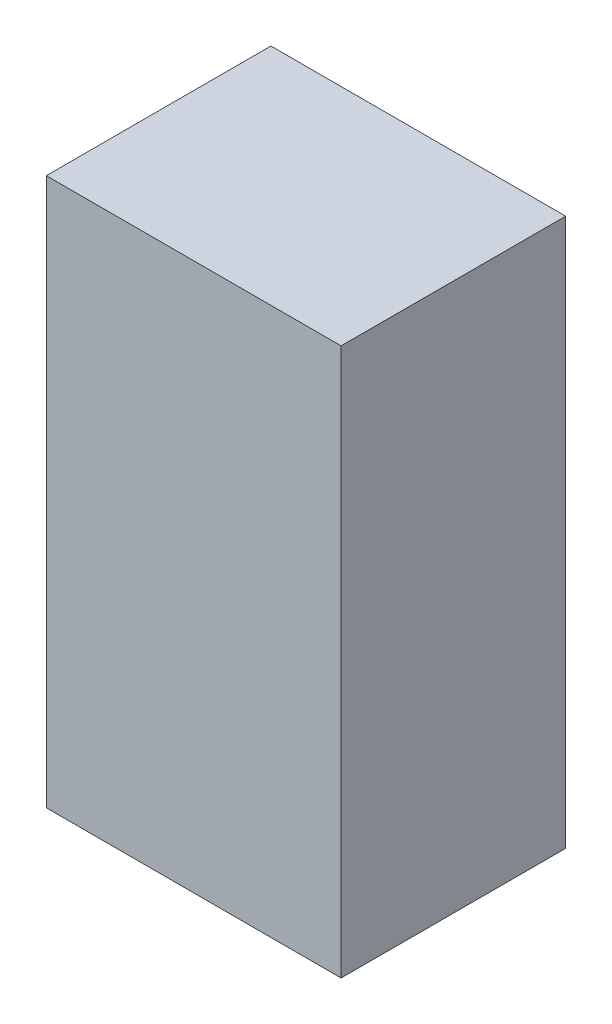
ISO-10303-21;
HEADER;
FILE_DESCRIPTION(('STEP AP214'),'2;1');
FILE_NAME('part.step','',(''),(''),'','','');
FILE_SCHEMA(('AUTOMOTIVE_DESIGN { 1 0 10303 214 1 1 1 1 }'));
ENDSEC;
DATA;
#1=APPLICATION_CONTEXT('core data for automotive mechanical design processes');
#2=APPLICATION_PROTOCOL_DEFINITION('international standard','automotive_design',2000,#1);
#3=PRODUCT_CONTEXT('',#1,'mechanical');
#4=PRODUCT('Part','Part','',(#3));
#5=PRODUCT_RELATED_PRODUCT_CATEGORY('part','',(#4));
#6=PRODUCT_DEFINITION_FORMATION('','',#4);
#7=PRODUCT_DEFINITION_CONTEXT('part definition',#1,'design');
#8=PRODUCT_DEFINITION('design','',#6,#7);
#9=PRODUCT_DEFINITION_SHAPE('','',#8);
#10=(LENGTH_UNIT() NAMED_UNIT(*) SI_UNIT(.MILLI.,.METRE.));
#11=(NAMED_UNIT(*) PLANE_ANGLE_UNIT() SI_UNIT($,.RADIAN.));
#12=(NAMED_UNIT(*) SI_UNIT($,.STERADIAN.) SOLID_ANGLE_UNIT());
#13=UNCERTAINTY_MEASURE_WITH_UNIT(LENGTH_MEASURE(1.E-05),#10,'distance_accuracy_value','');
#14=(GEOMETRIC_REPRESENTATION_CONTEXT(3) GLOBAL_UNCERTAINTY_ASSIGNED_CONTEXT((#13)) GLOBAL_UNIT_ASSIGNED_CONTEXT((#10,
#11,#12)) REPRESENTATION_CONTEXT('',''));
#15=CARTESIAN_POINT('',(0.,0.,0.));
#16=DIRECTION('',(0.,0.,1.));
#17=DIRECTION('',(1.,0.,0.));
#18=AXIS2_PLACEMENT_3D('',#15,#16,#17);
#19=CARTESIAN_POINT('',(-0.52500022,-0.97499932,0.80000094));
#20=DIRECTION('',(0.,0.,-1.));
#21=DIRECTION('',(-1.,0.,0.));
#22=AXIS2_PLACEMENT_3D('',#19,#20,#21);
#23=PLANE('',#22);
#24=DIRECTION('',(0.,1.,0.));
#25=VECTOR('',#24,1.);
#26=CARTESIAN_POINT('',(0.52500022,-0.97499932,0.80000094));
#27=LINE('',#26,#25);
#28=CARTESIAN_POINT('',(0.52500022,-0.97499932,0.80000094));
#29=VERTEX_POINT('',#28);
#30=CARTESIAN_POINT('',(0.52500022,0.97500186,0.80000094));
#31=VERTEX_POINT('',#30);
#32=EDGE_CURVE('E55',#29,#31,#27,.T.);
#33=ORIENTED_EDGE('',*,*,#32,.T.);
#34=DIRECTION('',(1.,0.,0.));
#35=VECTOR('',#34,1.);
#36=CARTESIAN_POINT('',(0.52500022,0.97500186,0.80000094));
#37=LINE('',#36,#35);
#38=CARTESIAN_POINT('',(-0.52500022,0.97500186,0.80000094));
#39=VERTEX_POINT('',#38);
#40=EDGE_CURVE('E58',#31,#39,#37,.F.);
#41=ORIENTED_EDGE('',*,*,#40,.T.);
#42=DIRECTION('',(0.,1.,0.));
#43=VECTOR('',#42,1.);
#44=CARTESIAN_POINT('',(-0.52500022,0.97500186,0.80000094));
#45=LINE('',#44,#43);
#46=CARTESIAN_POINT('',(-0.52500022,-0.97499932,0.80000094));
#47=VERTEX_POINT('',#46);
#48=EDGE_CURVE('E60',#39,#47,#45,.F.);
#49=ORIENTED_EDGE('',*,*,#48,.T.);
#50=DIRECTION('',(-1.,0.,0.));
#51=VECTOR('',#50,1.);
#52=CARTESIAN_POINT('',(-0.52500022,-0.97499932,0.80000094));
#53=LINE('',#52,#51);
#54=EDGE_CURVE('E20',#29,#47,#53,.T.);
#55=ORIENTED_EDGE('',*,*,#54,.F.);
#56=EDGE_LOOP('',(#33,#41,#49,#55));
#57=FACE_BOUND('',#56,.T.);
#58=ADVANCED_FACE('F17',(#57),#23,.F.);
#59=CARTESIAN_POINT('',(-0.52500022,0.97500186,0.));
#60=DIRECTION('',(1.,0.,0.));
#61=DIRECTION('',(0.,0.,-1.));
#62=AXIS2_PLACEMENT_3D('',#59,#60,#61);
#63=PLANE('',#62);
#64=DIRECTION('',(0.,0.,1.));
#65=VECTOR('',#64,1.);
#66=CARTESIAN_POINT('',(-0.52500022,-0.97499932,0.));
#67=LINE('',#66,#65);
#68=CARTESIAN_POINT('',(-0.52500022,-0.97499932,0.));
#69=VERTEX_POINT('',#68);
#70=EDGE_CURVE('E71',#69,#47,#67,.T.);
#71=ORIENTED_EDGE('',*,*,#70,.T.);
#72=ORIENTED_EDGE('',*,*,#48,.F.);
#73=DIRECTION('',(0.,0.,-1.));
#74=VECTOR('',#73,1.);
#75=CARTESIAN_POINT('',(-0.52500022,0.97500186,0.));
#76=LINE('',#75,#74);
#77=CARTESIAN_POINT('',(-0.52500022,0.97500186,0.));
#78=VERTEX_POINT('',#77);
#79=EDGE_CURVE('E65',#39,#78,#76,.T.);
#80=ORIENTED_EDGE('',*,*,#79,.T.);
#81=DIRECTION('',(0.,1.,0.));
#82=VECTOR('',#81,1.);
#83=CARTESIAN_POINT('',(-0.52500022,-0.97499932,0.));
#84=LINE('',#83,#82);
#85=EDGE_CURVE('E83',#69,#78,#84,.T.);
#86=ORIENTED_EDGE('',*,*,#85,.F.);
#87=EDGE_LOOP('',(#71,#72,#80,#86));
#88=FACE_BOUND('',#87,.T.);
#89=ADVANCED_FACE('F68',(#88),#63,.F.);
#90=CARTESIAN_POINT('',(0.52500022,0.97500186,0.));
#91=DIRECTION('',(0.,-1.,0.));
#92=DIRECTION('',(0.,0.,-1.));
#93=AXIS2_PLACEMENT_3D('',#90,#91,#92);
#94=PLANE('',#93);
#95=ORIENTED_EDGE('',*,*,#79,.F.);
#96=ORIENTED_EDGE('',*,*,#40,.F.);
#97=DIRECTION('',(0.,0.,1.));
#98=VECTOR('',#97,1.);
#99=CARTESIAN_POINT('',(0.52500022,0.97500186,0.));
#100=LINE('',#99,#98);
#101=CARTESIAN_POINT('',(0.52500022,0.97500186,0.));
#102=VERTEX_POINT('',#101);
#103=EDGE_CURVE('E77',#31,#102,#100,.F.);
#104=ORIENTED_EDGE('',*,*,#103,.T.);
#105=DIRECTION('',(-1.,0.,0.));
#106=VECTOR('',#105,1.);
#107=CARTESIAN_POINT('',(-0.52500022,0.97500186,0.));
#108=LINE('',#107,#106);
#109=EDGE_CURVE('E74',#78,#102,#108,.F.);
#110=ORIENTED_EDGE('',*,*,#109,.F.);
#111=EDGE_LOOP('',(#95,#96,#104,#110));
#112=FACE_BOUND('',#111,.T.);
#113=ADVANCED_FACE('F72',(#112),#94,.F.);
#114=CARTESIAN_POINT('',(0.52500022,-0.97499932,0.));
#115=DIRECTION('',(-1.,0.,0.));
#116=DIRECTION('',(0.,0.,1.));
#117=AXIS2_PLACEMENT_3D('',#114,#115,#116);
#118=PLANE('',#117);
#119=ORIENTED_EDGE('',*,*,#103,.F.);
#120=ORIENTED_EDGE('',*,*,#32,.F.);
#121=DIRECTION('',(0.,0.,1.));
#122=VECTOR('',#121,1.);
#123=CARTESIAN_POINT('',(0.52500022,-0.97499932,0.));
#124=LINE('',#123,#122);
#125=CARTESIAN_POINT('',(0.52500022,-0.97499932,0.));
#126=VERTEX_POINT('',#125);
#127=EDGE_CURVE('E35',#29,#126,#124,.F.);
#128=ORIENTED_EDGE('',*,*,#127,.T.);
#129=DIRECTION('',(0.,1.,0.));
#130=VECTOR('',#129,1.);
#131=CARTESIAN_POINT('',(0.52500022,-0.97499932,0.));
#132=LINE('',#131,#130);
#133=EDGE_CURVE('E26',#102,#126,#132,.F.);
#134=ORIENTED_EDGE('',*,*,#133,.F.);
#135=EDGE_LOOP('',(#119,#120,#128,#134));
#136=FACE_BOUND('',#135,.T.);
#137=ADVANCED_FACE('F89',(#136),#118,.F.);
#138=CARTESIAN_POINT('',(-0.52500022,-0.97499932,0.));
#139=DIRECTION('',(0.,1.,0.));
#140=DIRECTION('',(0.,0.,1.));
#141=AXIS2_PLACEMENT_3D('',#138,#139,#140);
#142=PLANE('',#141);
#143=ORIENTED_EDGE('',*,*,#127,.F.);
#144=ORIENTED_EDGE('',*,*,#54,.T.);
#145=ORIENTED_EDGE('',*,*,#70,.F.);
#146=DIRECTION('',(-1.,0.,0.));
#147=VECTOR('',#146,1.);
#148=CARTESIAN_POINT('',(-0.52500022,-0.97499932,0.));
#149=LINE('',#148,#147);
#150=EDGE_CURVE('E11',#126,#69,#149,.T.);
#151=ORIENTED_EDGE('',*,*,#150,.F.);
#152=EDGE_LOOP('',(#143,#144,#145,#151));
#153=FACE_BOUND('',#152,.T.);
#154=ADVANCED_FACE('F91',(#153),#142,.F.);
#155=CARTESIAN_POINT('',(-0.52500022,-0.97499932,0.));
#156=DIRECTION('',(0.,0.,-1.));
#157=DIRECTION('',(-1.,0.,0.));
#158=AXIS2_PLACEMENT_3D('',#155,#156,#157);
#159=PLANE('',#158);
#160=ORIENTED_EDGE('',*,*,#133,.T.);
#161=ORIENTED_EDGE('',*,*,#150,.T.);
#162=ORIENTED_EDGE('',*,*,#85,.T.);
#163=ORIENTED_EDGE('',*,*,#109,.T.);
#164=EDGE_LOOP('',(#160,#161,#162,#163));
#165=FACE_BOUND('',#164,.T.);
#166=ADVANCED_FACE('F88',(#165),#159,.T.);
#167=CLOSED_SHELL('',(#58,#89,#113,#137,#154,#166));
#168=MANIFOLD_SOLID_BREP('B1',#167);
#169=ADVANCED_BREP_SHAPE_REPRESENTATION('',(#18,#168),#14);
#170=SHAPE_DEFINITION_REPRESENTATION(#9,#169);
ENDSEC;
END-ISO-10303-21;
